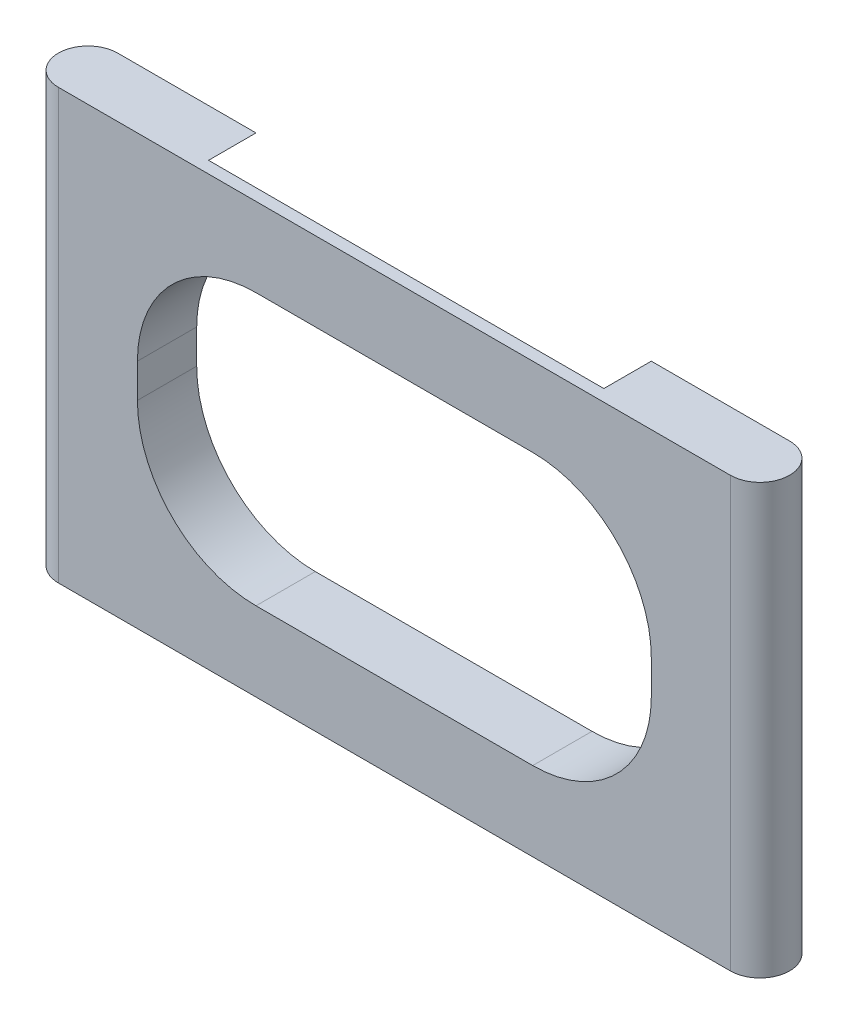
ISO-10303-21;
HEADER;
FILE_DESCRIPTION(('STEP AP214'),'2;1');
FILE_NAME('part.step','',(''),(''),'','','');
FILE_SCHEMA(('AUTOMOTIVE_DESIGN { 1 0 10303 214 1 1 1 1 }'));
ENDSEC;
DATA;
#1=APPLICATION_CONTEXT('core data for automotive mechanical design processes');
#2=APPLICATION_PROTOCOL_DEFINITION('international standard','automotive_design',2000,#1);
#3=PRODUCT_CONTEXT('',#1,'mechanical');
#4=PRODUCT('Part','Part','',(#3));
#5=PRODUCT_RELATED_PRODUCT_CATEGORY('part','',(#4));
#6=PRODUCT_DEFINITION_FORMATION('','',#4);
#7=PRODUCT_DEFINITION_CONTEXT('part definition',#1,'design');
#8=PRODUCT_DEFINITION('design','',#6,#7);
#9=PRODUCT_DEFINITION_SHAPE('','',#8);
#10=(LENGTH_UNIT() NAMED_UNIT(*) SI_UNIT(.MILLI.,.METRE.));
#11=(NAMED_UNIT(*) PLANE_ANGLE_UNIT() SI_UNIT($,.RADIAN.));
#12=(NAMED_UNIT(*) SI_UNIT($,.STERADIAN.) SOLID_ANGLE_UNIT());
#13=UNCERTAINTY_MEASURE_WITH_UNIT(LENGTH_MEASURE(1.E-05),#10,'distance_accuracy_value','');
#14=(GEOMETRIC_REPRESENTATION_CONTEXT(3) GLOBAL_UNCERTAINTY_ASSIGNED_CONTEXT((#13)) GLOBAL_UNIT_ASSIGNED_CONTEXT((#10,
#11,#12)) REPRESENTATION_CONTEXT('',''));
#15=CARTESIAN_POINT('',(0.,0.,0.));
#16=DIRECTION('',(0.,0.,1.));
#17=DIRECTION('',(1.,0.,0.));
#18=AXIS2_PLACEMENT_3D('',#15,#16,#17);
#19=CARTESIAN_POINT('',(-85.,117.6,0.));
#20=DIRECTION('',(0.,-1.,0.));
#21=DIRECTION('',(0.,0.,-1.));
#22=AXIS2_PLACEMENT_3D('',#19,#20,#21);
#23=CYLINDRICAL_SURFACE('',#22,7.50000000000001);
#24=CARTESIAN_POINT('',(-85.,113.1,0.));
#25=DIRECTION('',(0.,1.,0.));
#26=DIRECTION('',(0.,0.,1.));
#27=AXIS2_PLACEMENT_3D('',#24,#25,#26);
#28=CIRCLE('',#27,7.50000000000001);
#29=CARTESIAN_POINT('',(-85.,113.1,-7.5));
#30=VERTEX_POINT('',#29);
#31=CARTESIAN_POINT('',(-85.,113.1,7.50000000000002));
#32=VERTEX_POINT('',#31);
#33=EDGE_CURVE('E262',#30,#32,#28,.T.);
#34=ORIENTED_EDGE('',*,*,#33,.F.);
#35=DIRECTION('',(0.,-1.,0.));
#36=VECTOR('',#35,1.);
#37=CARTESIAN_POINT('',(-85.,117.6,-7.5));
#38=LINE('',#37,#36);
#39=CARTESIAN_POINT('',(-85.,78.1,-7.49999999999999));
#40=VERTEX_POINT('',#39);
#41=EDGE_CURVE('E12',#30,#40,#38,.T.);
#42=ORIENTED_EDGE('',*,*,#41,.T.);
#43=DIRECTION('',(0.,1.,0.));
#44=VECTOR('',#43,1.);
#45=CARTESIAN_POINT('',(-85.,78.1,-7.49999999999999));
#46=LINE('',#45,#44);
#47=CARTESIAN_POINT('',(-85.,39.5,-7.49999999999999));
#48=VERTEX_POINT('',#47);
#49=EDGE_CURVE('E289',#48,#40,#46,.T.);
#50=ORIENTED_EDGE('',*,*,#49,.F.);
#51=CARTESIAN_POINT('',(-85.,4.5,-7.50000000000001));
#52=VERTEX_POINT('',#51);
#53=EDGE_CURVE('E84',#48,#52,#38,.T.);
#54=ORIENTED_EDGE('',*,*,#53,.T.);
#55=CARTESIAN_POINT('',(-85.,4.5,0.));
#56=DIRECTION('',(0.,-1.,0.));
#57=DIRECTION('',(0.,0.,-1.));
#58=AXIS2_PLACEMENT_3D('',#55,#56,#57);
#59=CIRCLE('',#58,7.50000000000001);
#60=CARTESIAN_POINT('',(-85.,4.50000000000006,7.50000000000002));
#61=VERTEX_POINT('',#60);
#62=EDGE_CURVE('E349',#61,#52,#59,.T.);
#63=ORIENTED_EDGE('',*,*,#62,.F.);
#64=DIRECTION('',(0.,-1.,0.));
#65=VECTOR('',#64,1.);
#66=CARTESIAN_POINT('',(-85.,117.6,7.50000000000002));
#67=LINE('',#66,#65);
#68=EDGE_CURVE('E279',#32,#61,#67,.T.);
#69=ORIENTED_EDGE('',*,*,#68,.F.);
#70=EDGE_LOOP('',(#34,#42,#50,#54,#63,#69));
#71=FACE_BOUND('',#70,.T.);
#72=ADVANCED_FACE('F75',(#71),#23,.T.);
#73=CARTESIAN_POINT('',(0.,117.6,7.50000000000001));
#74=DIRECTION('',(0.,0.,1.));
#75=DIRECTION('',(1.,0.,0.));
#76=AXIS2_PLACEMENT_3D('',#73,#74,#75);
#77=PLANE('',#76);
#78=CARTESIAN_POINT('',(35.,54.5,7.50000000000003));
#79=DIRECTION('',(0.,0.,-1.));
#80=DIRECTION('',(-1.,0.,0.));
#81=AXIS2_PLACEMENT_3D('',#78,#79,#80);
#82=CIRCLE('',#81,30.);
#83=CARTESIAN_POINT('',(65.,54.5,7.50000000000002));
#84=VERTEX_POINT('',#83);
#85=CARTESIAN_POINT('',(35.,24.5,7.50000000000003));
#86=VERTEX_POINT('',#85);
#87=EDGE_CURVE('E367',#84,#86,#82,.T.);
#88=ORIENTED_EDGE('',*,*,#87,.T.);
#89=DIRECTION('',(-1.,0.,0.));
#90=VECTOR('',#89,1.);
#91=CARTESIAN_POINT('',(35.,24.5,7.50000000000003));
#92=LINE('',#91,#90);
#93=CARTESIAN_POINT('',(-35.,24.5,7.50000000000002));
#94=VERTEX_POINT('',#93);
#95=EDGE_CURVE('E371',#86,#94,#92,.T.);
#96=ORIENTED_EDGE('',*,*,#95,.T.);
#97=CARTESIAN_POINT('',(-35.,54.5,7.50000000000004));
#98=DIRECTION('',(0.,0.,-1.));
#99=DIRECTION('',(-1.,0.,0.));
#100=AXIS2_PLACEMENT_3D('',#97,#98,#99);
#101=CIRCLE('',#100,30.);
#102=CARTESIAN_POINT('',(-65.,54.5,7.50000000000005));
#103=VERTEX_POINT('',#102);
#104=EDGE_CURVE('E91',#94,#103,#101,.T.);
#105=ORIENTED_EDGE('',*,*,#104,.T.);
#106=DIRECTION('',(0.,1.,0.));
#107=VECTOR('',#106,1.);
#108=CARTESIAN_POINT('',(-65.,54.5,7.50000000000005));
#109=LINE('',#108,#107);
#110=CARTESIAN_POINT('',(-65.,63.1,7.50000000000004));
#111=VERTEX_POINT('',#110);
#112=EDGE_CURVE('E378',#103,#111,#109,.T.);
#113=ORIENTED_EDGE('',*,*,#112,.T.);
#114=CARTESIAN_POINT('',(-35.,63.1,7.50000000000004));
#115=DIRECTION('',(0.,0.,-1.));
#116=DIRECTION('',(-1.,0.,0.));
#117=AXIS2_PLACEMENT_3D('',#114,#115,#116);
#118=CIRCLE('',#117,30.);
#119=CARTESIAN_POINT('',(-35.,93.1,7.50000000000004));
#120=VERTEX_POINT('',#119);
#121=EDGE_CURVE('E382',#111,#120,#118,.T.);
#122=ORIENTED_EDGE('',*,*,#121,.T.);
#123=DIRECTION('',(1.,0.,0.));
#124=VECTOR('',#123,1.);
#125=CARTESIAN_POINT('',(-35.,93.1,7.50000000000004));
#126=LINE('',#125,#124);
#127=CARTESIAN_POINT('',(35.,93.1,7.50000000000003));
#128=VERTEX_POINT('',#127);
#129=EDGE_CURVE('E386',#120,#128,#126,.T.);
#130=ORIENTED_EDGE('',*,*,#129,.T.);
#131=CARTESIAN_POINT('',(35.,63.1,7.50000000000003));
#132=DIRECTION('',(0.,0.,-1.));
#133=DIRECTION('',(-1.,0.,0.));
#134=AXIS2_PLACEMENT_3D('',#131,#132,#133);
#135=CIRCLE('',#134,30.);
#136=CARTESIAN_POINT('',(65.,63.1,7.50000000000002));
#137=VERTEX_POINT('',#136);
#138=EDGE_CURVE('E390',#128,#137,#135,.T.);
#139=ORIENTED_EDGE('',*,*,#138,.T.);
#140=DIRECTION('',(0.,-1.,0.));
#141=VECTOR('',#140,1.);
#142=CARTESIAN_POINT('',(65.,63.1,7.50000000000002));
#143=LINE('',#142,#141);
#144=EDGE_CURVE('E394',#137,#84,#143,.T.);
#145=ORIENTED_EDGE('',*,*,#144,.T.);
#146=EDGE_LOOP('',(#88,#96,#105,#113,#122,#130,#139,#145));
#147=FACE_BOUND('',#146,.T.);
#148=DIRECTION('',(0.,-1.,0.));
#149=VECTOR('',#148,1.);
#150=CARTESIAN_POINT('',(85.,117.6,7.5));
#151=LINE('',#150,#149);
#152=CARTESIAN_POINT('',(85.,113.1,7.5));
#153=VERTEX_POINT('',#152);
#154=CARTESIAN_POINT('',(85.,4.5,7.5));
#155=VERTEX_POINT('',#154);
#156=EDGE_CURVE('E340',#153,#155,#151,.T.);
#157=ORIENTED_EDGE('',*,*,#156,.F.);
#158=DIRECTION('',(1.,0.,0.));
#159=VECTOR('',#158,1.);
#160=CARTESIAN_POINT('',(50.,113.1,7.50000000000001));
#161=LINE('',#160,#159);
#162=EDGE_CURVE('E282',#32,#153,#161,.T.);
#163=ORIENTED_EDGE('',*,*,#162,.F.);
#164=ORIENTED_EDGE('',*,*,#68,.T.);
#165=DIRECTION('',(1.,0.,0.));
#166=VECTOR('',#165,1.);
#167=CARTESIAN_POINT('',(0.,4.5,7.50000000000001));
#168=LINE('',#167,#166);
#169=EDGE_CURVE('E362',#61,#155,#168,.T.);
#170=ORIENTED_EDGE('',*,*,#169,.T.);
#171=EDGE_LOOP('',(#157,#163,#164,#170));
#172=FACE_BOUND('',#171,.T.);
#173=ADVANCED_FACE('F610',(#147,#172),#77,.T.);
#174=CARTESIAN_POINT('',(85.,117.6,0.));
#175=DIRECTION('',(0.,-1.,0.));
#176=DIRECTION('',(0.,0.,-1.));
#177=AXIS2_PLACEMENT_3D('',#174,#175,#176);
#178=CYLINDRICAL_SURFACE('',#177,7.5);
#179=CARTESIAN_POINT('',(85.,113.1,0.));
#180=DIRECTION('',(0.,1.,0.));
#181=DIRECTION('',(0.,0.,1.));
#182=AXIS2_PLACEMENT_3D('',#179,#180,#181);
#183=CIRCLE('',#182,7.5);
#184=CARTESIAN_POINT('',(85.,113.1,-7.5));
#185=VERTEX_POINT('',#184);
#186=EDGE_CURVE('E271',#153,#185,#183,.T.);
#187=ORIENTED_EDGE('',*,*,#186,.F.);
#188=ORIENTED_EDGE('',*,*,#156,.T.);
#189=CARTESIAN_POINT('',(85.,4.5,0.));
#190=DIRECTION('',(0.,-1.,0.));
#191=DIRECTION('',(0.,0.,-1.));
#192=AXIS2_PLACEMENT_3D('',#189,#190,#191);
#193=CIRCLE('',#192,7.5);
#194=CARTESIAN_POINT('',(85.,4.5,-7.5));
#195=VERTEX_POINT('',#194);
#196=EDGE_CURVE('E281',#195,#155,#193,.T.);
#197=ORIENTED_EDGE('',*,*,#196,.F.);
#198=DIRECTION('',(0.,-1.,0.));
#199=VECTOR('',#198,1.);
#200=CARTESIAN_POINT('',(85.,117.6,-7.5));
#201=LINE('',#200,#199);
#202=CARTESIAN_POINT('',(85.,39.5,-7.50000000000001));
#203=VERTEX_POINT('',#202);
#204=EDGE_CURVE('E313',#203,#195,#201,.T.);
#205=ORIENTED_EDGE('',*,*,#204,.F.);
#206=DIRECTION('',(0.,-1.,0.));
#207=VECTOR('',#206,1.);
#208=CARTESIAN_POINT('',(85.,78.1,-7.50000000000001));
#209=LINE('',#208,#207);
#210=CARTESIAN_POINT('',(85.,78.1,-7.5));
#211=VERTEX_POINT('',#210);
#212=EDGE_CURVE('E294',#211,#203,#209,.T.);
#213=ORIENTED_EDGE('',*,*,#212,.F.);
#214=EDGE_CURVE('E337',#185,#211,#201,.T.);
#215=ORIENTED_EDGE('',*,*,#214,.F.);
#216=EDGE_LOOP('',(#187,#188,#197,#205,#213,#215));
#217=FACE_BOUND('',#216,.T.);
#218=ADVANCED_FACE('F596',(#217),#178,.T.);
#219=CARTESIAN_POINT('',(0.,117.6,-7.5));
#220=DIRECTION('',(0.,0.,1.));
#221=DIRECTION('',(1.,0.,0.));
#222=AXIS2_PLACEMENT_3D('',#219,#220,#221);
#223=PLANE('',#222);
#224=DIRECTION('',(1.,0.,0.));
#225=VECTOR('',#224,1.);
#226=CARTESIAN_POINT('',(50.,113.1,-7.5));
#227=LINE('',#226,#225);
#228=CARTESIAN_POINT('',(50.,113.1,-7.5));
#229=VERTEX_POINT('',#228);
#230=EDGE_CURVE('E272',#229,#185,#227,.T.);
#231=ORIENTED_EDGE('',*,*,#230,.T.);
#232=ORIENTED_EDGE('',*,*,#214,.T.);
#233=CARTESIAN_POINT('',(50.,78.1,-7.50000000000001));
#234=DIRECTION('',(0.,0.,-1.));
#235=DIRECTION('',(-1.,0.,0.));
#236=AXIS2_PLACEMENT_3D('',#233,#234,#235);
#237=CIRCLE('',#236,35.);
#238=EDGE_CURVE('E288',#229,#211,#237,.T.);
#239=ORIENTED_EDGE('',*,*,#238,.F.);
#240=EDGE_LOOP('',(#231,#232,#239));
#241=FACE_BOUND('',#240,.T.);
#242=ADVANCED_FACE('F77',(#241),#223,.F.);
#243=CARTESIAN_POINT('',(-50.,113.1,-7.5));
#244=VERTEX_POINT('',#243);
#245=EDGE_CURVE('E259',#30,#244,#227,.T.);
#246=ORIENTED_EDGE('',*,*,#245,.T.);
#247=CARTESIAN_POINT('',(-50.,78.1,-7.49999999999999));
#248=DIRECTION('',(0.,0.,-1.));
#249=DIRECTION('',(1.,0.,0.));
#250=AXIS2_PLACEMENT_3D('',#247,#248,#249);
#251=CIRCLE('',#250,35.);
#252=EDGE_CURVE('E285',#40,#244,#251,.T.);
#253=ORIENTED_EDGE('',*,*,#252,.F.);
#254=ORIENTED_EDGE('',*,*,#41,.F.);
#255=EDGE_LOOP('',(#246,#253,#254));
#256=FACE_BOUND('',#255,.T.);
#257=ADVANCED_FACE('F284',(#256),#223,.F.);
#258=DIRECTION('',(1.,0.,0.));
#259=VECTOR('',#258,1.);
#260=CARTESIAN_POINT('',(0.,4.5,-7.5));
#261=LINE('',#260,#259);
#262=CARTESIAN_POINT('',(-50.,4.5,-7.5));
#263=VERTEX_POINT('',#262);
#264=EDGE_CURVE('E355',#52,#263,#261,.T.);
#265=ORIENTED_EDGE('',*,*,#264,.F.);
#266=ORIENTED_EDGE('',*,*,#53,.F.);
#267=CARTESIAN_POINT('',(-50.,39.5,-7.49999999999999));
#268=DIRECTION('',(0.,0.,-1.));
#269=DIRECTION('',(-1.,0.,0.));
#270=AXIS2_PLACEMENT_3D('',#267,#268,#269);
#271=CIRCLE('',#270,35.);
#272=EDGE_CURVE('E297',#263,#48,#271,.T.);
#273=ORIENTED_EDGE('',*,*,#272,.F.);
#274=EDGE_LOOP('',(#265,#266,#273));
#275=FACE_BOUND('',#274,.T.);
#276=ADVANCED_FACE('F353',(#275),#223,.F.);
#277=CARTESIAN_POINT('',(50.,4.5,-7.5));
#278=VERTEX_POINT('',#277);
#279=EDGE_CURVE('E358',#278,#195,#261,.T.);
#280=ORIENTED_EDGE('',*,*,#279,.F.);
#281=CARTESIAN_POINT('',(50.,39.5,-7.50000000000001));
#282=DIRECTION('',(0.,0.,-1.));
#283=DIRECTION('',(-1.,0.,0.));
#284=AXIS2_PLACEMENT_3D('',#281,#282,#283);
#285=CIRCLE('',#284,35.);
#286=EDGE_CURVE('E304',#203,#278,#285,.T.);
#287=ORIENTED_EDGE('',*,*,#286,.F.);
#288=ORIENTED_EDGE('',*,*,#204,.T.);
#289=EDGE_LOOP('',(#280,#287,#288));
#290=FACE_BOUND('',#289,.T.);
#291=ADVANCED_FACE('F593',(#290),#223,.F.);
#292=CARTESIAN_POINT('',(-50.,39.5,4.50000000000001));
#293=DIRECTION('',(0.,0.,-1.));
#294=DIRECTION('',(-1.,0.,0.));
#295=AXIS2_PLACEMENT_3D('',#292,#293,#294);
#296=CYLINDRICAL_SURFACE('',#295,35.);
#297=ORIENTED_EDGE('',*,*,#272,.T.);
#298=DIRECTION('',(0.,0.,-1.));
#299=VECTOR('',#298,1.);
#300=CARTESIAN_POINT('',(-85.,39.5,4.50000000000001));
#301=LINE('',#300,#299);
#302=CARTESIAN_POINT('',(-85.,39.5,4.50000000000001));
#303=VERTEX_POINT('',#302);
#304=EDGE_CURVE('E333',#303,#48,#301,.T.);
#305=ORIENTED_EDGE('',*,*,#304,.F.);
#306=CARTESIAN_POINT('',(-50.,39.5,4.50000000000001));
#307=DIRECTION('',(0.,0.,-1.));
#308=DIRECTION('',(-1.,0.,0.));
#309=AXIS2_PLACEMENT_3D('',#306,#307,#308);
#310=CIRCLE('',#309,35.);
#311=CARTESIAN_POINT('',(-50.,4.5,4.50000000000001));
#312=VERTEX_POINT('',#311);
#313=EDGE_CURVE('E308',#312,#303,#310,.T.);
#314=ORIENTED_EDGE('',*,*,#313,.F.);
#315=DIRECTION('',(0.,0.,-1.));
#316=VECTOR('',#315,1.);
#317=CARTESIAN_POINT('',(-50.,4.5,4.50000000000001));
#318=LINE('',#317,#316);
#319=EDGE_CURVE('E309',#312,#263,#318,.T.);
#320=ORIENTED_EDGE('',*,*,#319,.T.);
#321=EDGE_LOOP('',(#297,#305,#314,#320));
#322=FACE_BOUND('',#321,.T.);
#323=ADVANCED_FACE('F571',(#322),#296,.F.);
#324=CARTESIAN_POINT('',(50.,39.5,4.49999999999999));
#325=DIRECTION('',(0.,0.,-1.));
#326=DIRECTION('',(-1.,0.,0.));
#327=AXIS2_PLACEMENT_3D('',#324,#325,#326);
#328=CYLINDRICAL_SURFACE('',#327,35.);
#329=ORIENTED_EDGE('',*,*,#286,.T.);
#330=DIRECTION('',(0.,0.,-1.));
#331=VECTOR('',#330,1.);
#332=CARTESIAN_POINT('',(50.,4.5,4.49999999999999));
#333=LINE('',#332,#331);
#334=CARTESIAN_POINT('',(50.,4.5,4.49999999999999));
#335=VERTEX_POINT('',#334);
#336=EDGE_CURVE('E314',#335,#278,#333,.T.);
#337=ORIENTED_EDGE('',*,*,#336,.F.);
#338=CARTESIAN_POINT('',(50.,39.5,4.49999999999999));
#339=DIRECTION('',(0.,0.,-1.));
#340=DIRECTION('',(-1.,0.,0.));
#341=AXIS2_PLACEMENT_3D('',#338,#339,#340);
#342=CIRCLE('',#341,35.);
#343=CARTESIAN_POINT('',(85.,39.5,4.49999999999999));
#344=VERTEX_POINT('',#343);
#345=EDGE_CURVE('E563',#344,#335,#342,.T.);
#346=ORIENTED_EDGE('',*,*,#345,.F.);
#347=DIRECTION('',(0.,0.,-1.));
#348=VECTOR('',#347,1.);
#349=CARTESIAN_POINT('',(85.,39.5,4.49999999999999));
#350=LINE('',#349,#348);
#351=EDGE_CURVE('E317',#344,#203,#350,.T.);
#352=ORIENTED_EDGE('',*,*,#351,.T.);
#353=EDGE_LOOP('',(#329,#337,#346,#352));
#354=FACE_BOUND('',#353,.T.);
#355=ADVANCED_FACE('F580',(#354),#328,.F.);
#356=CARTESIAN_POINT('',(85.,78.1,4.49999999999999));
#357=DIRECTION('',(1.,0.,0.));
#358=DIRECTION('',(0.,0.,-1.));
#359=AXIS2_PLACEMENT_3D('',#356,#357,#358);
#360=PLANE('',#359);
#361=ORIENTED_EDGE('',*,*,#212,.T.);
#362=ORIENTED_EDGE('',*,*,#351,.F.);
#363=DIRECTION('',(0.,-1.,0.));
#364=VECTOR('',#363,1.);
#365=CARTESIAN_POINT('',(85.,78.1,4.49999999999999));
#366=LINE('',#365,#364);
#367=CARTESIAN_POINT('',(85.,78.1,4.49999999999999));
#368=VERTEX_POINT('',#367);
#369=EDGE_CURVE('E559',#368,#344,#366,.T.);
#370=ORIENTED_EDGE('',*,*,#369,.F.);
#371=DIRECTION('',(0.,0.,-1.));
#372=VECTOR('',#371,1.);
#373=CARTESIAN_POINT('',(85.,78.1,4.49999999999999));
#374=LINE('',#373,#372);
#375=EDGE_CURVE('E320',#368,#211,#374,.T.);
#376=ORIENTED_EDGE('',*,*,#375,.T.);
#377=EDGE_LOOP('',(#361,#362,#370,#376));
#378=FACE_BOUND('',#377,.T.);
#379=ADVANCED_FACE('F586',(#378),#360,.F.);
#380=CARTESIAN_POINT('',(50.,78.1,4.49999999999999));
#381=DIRECTION('',(0.,0.,-1.));
#382=DIRECTION('',(-1.,0.,0.));
#383=AXIS2_PLACEMENT_3D('',#380,#381,#382);
#384=CYLINDRICAL_SURFACE('',#383,35.);
#385=ORIENTED_EDGE('',*,*,#238,.T.);
#386=ORIENTED_EDGE('',*,*,#375,.F.);
#387=CARTESIAN_POINT('',(50.,78.1,4.49999999999999));
#388=DIRECTION('',(0.,0.,-1.));
#389=DIRECTION('',(-1.,0.,0.));
#390=AXIS2_PLACEMENT_3D('',#387,#388,#389);
#391=CIRCLE('',#390,35.);
#392=CARTESIAN_POINT('',(50.,113.1,4.49999999999999));
#393=VERTEX_POINT('',#392);
#394=EDGE_CURVE('E555',#393,#368,#391,.T.);
#395=ORIENTED_EDGE('',*,*,#394,.F.);
#396=DIRECTION('',(0.,0.,-1.));
#397=VECTOR('',#396,1.);
#398=CARTESIAN_POINT('',(50.,113.1,4.49999999999999));
#399=LINE('',#398,#397);
#400=EDGE_CURVE('E324',#393,#229,#399,.T.);
#401=ORIENTED_EDGE('',*,*,#400,.T.);
#402=EDGE_LOOP('',(#385,#386,#395,#401));
#403=FACE_BOUND('',#402,.T.);
#404=ADVANCED_FACE('F612',(#403),#384,.F.);
#405=CARTESIAN_POINT('',(-50.,78.1,4.50000000000001));
#406=DIRECTION('',(0.,0.,-1.));
#407=DIRECTION('',(-1.,0.,0.));
#408=AXIS2_PLACEMENT_3D('',#405,#406,#407);
#409=CYLINDRICAL_SURFACE('',#408,35.);
#410=ORIENTED_EDGE('',*,*,#252,.T.);
#411=DIRECTION('',(0.,0.,-1.));
#412=VECTOR('',#411,1.);
#413=CARTESIAN_POINT('',(-50.,113.1,4.50000000000001));
#414=LINE('',#413,#412);
#415=CARTESIAN_POINT('',(-50.,113.1,4.50000000000001));
#416=VERTEX_POINT('',#415);
#417=EDGE_CURVE('E265',#416,#244,#414,.T.);
#418=ORIENTED_EDGE('',*,*,#417,.F.);
#419=CARTESIAN_POINT('',(-50.,78.1,4.50000000000001));
#420=DIRECTION('',(0.,0.,-1.));
#421=DIRECTION('',(1.,0.,0.));
#422=AXIS2_PLACEMENT_3D('',#419,#420,#421);
#423=CIRCLE('',#422,35.);
#424=CARTESIAN_POINT('',(-85.,78.1,4.50000000000001));
#425=VERTEX_POINT('',#424);
#426=EDGE_CURVE('E547',#425,#416,#423,.T.);
#427=ORIENTED_EDGE('',*,*,#426,.F.);
#428=DIRECTION('',(0.,0.,-1.));
#429=VECTOR('',#428,1.);
#430=CARTESIAN_POINT('',(-85.,78.1,4.50000000000001));
#431=LINE('',#430,#429);
#432=EDGE_CURVE('E330',#425,#40,#431,.T.);
#433=ORIENTED_EDGE('',*,*,#432,.T.);
#434=EDGE_LOOP('',(#410,#418,#427,#433));
#435=FACE_BOUND('',#434,.T.);
#436=ADVANCED_FACE('F614',(#435),#409,.F.);
#437=CARTESIAN_POINT('',(-85.,78.1,4.50000000000001));
#438=DIRECTION('',(-1.,0.,0.));
#439=DIRECTION('',(0.,-1.,0.));
#440=AXIS2_PLACEMENT_3D('',#437,#438,#439);
#441=PLANE('',#440);
#442=ORIENTED_EDGE('',*,*,#49,.T.);
#443=ORIENTED_EDGE('',*,*,#432,.F.);
#444=DIRECTION('',(0.,1.,0.));
#445=VECTOR('',#444,1.);
#446=CARTESIAN_POINT('',(-85.,78.1,4.50000000000001));
#447=LINE('',#446,#445);
#448=EDGE_CURVE('E543',#303,#425,#447,.T.);
#449=ORIENTED_EDGE('',*,*,#448,.F.);
#450=ORIENTED_EDGE('',*,*,#304,.T.);
#451=EDGE_LOOP('',(#442,#443,#449,#450));
#452=FACE_BOUND('',#451,.T.);
#453=ADVANCED_FACE('F616',(#452),#441,.F.);
#454=CARTESIAN_POINT('',(-50.,39.5,4.50000000000001));
#455=DIRECTION('',(0.,0.,-1.));
#456=DIRECTION('',(-1.,0.,0.));
#457=AXIS2_PLACEMENT_3D('',#454,#455,#456);
#458=PLANE('',#457);
#459=DIRECTION('',(-1.,0.,0.));
#460=VECTOR('',#459,1.);
#461=CARTESIAN_POINT('',(35.,19.5,4.5));
#462=LINE('',#461,#460);
#463=CARTESIAN_POINT('',(35.,19.5,4.5));
#464=VERTEX_POINT('',#463);
#465=CARTESIAN_POINT('',(-35.,19.5,4.50000000000001));
#466=VERTEX_POINT('',#465);
#467=EDGE_CURVE('E481',#464,#466,#462,.T.);
#468=ORIENTED_EDGE('',*,*,#467,.F.);
#469=CARTESIAN_POINT('',(35.,54.5,4.5));
#470=DIRECTION('',(0.,0.,-1.));
#471=DIRECTION('',(-1.,0.,0.));
#472=AXIS2_PLACEMENT_3D('',#469,#470,#471);
#473=CIRCLE('',#472,35.);
#474=CARTESIAN_POINT('',(70.,54.5,4.49999999999999));
#475=VERTEX_POINT('',#474);
#476=EDGE_CURVE('E477',#475,#464,#473,.T.);
#477=ORIENTED_EDGE('',*,*,#476,.F.);
#478=DIRECTION('',(0.,-1.,0.));
#479=VECTOR('',#478,1.);
#480=CARTESIAN_POINT('',(70.,63.1,4.49999999999999));
#481=LINE('',#480,#479);
#482=CARTESIAN_POINT('',(70.,63.1,4.49999999999999));
#483=VERTEX_POINT('',#482);
#484=EDGE_CURVE('E473',#483,#475,#481,.T.);
#485=ORIENTED_EDGE('',*,*,#484,.F.);
#486=CARTESIAN_POINT('',(35.,63.1,4.5));
#487=DIRECTION('',(0.,0.,-1.));
#488=DIRECTION('',(1.,0.,0.));
#489=AXIS2_PLACEMENT_3D('',#486,#487,#488);
#490=CIRCLE('',#489,35.);
#491=CARTESIAN_POINT('',(35.,98.1,4.5));
#492=VERTEX_POINT('',#491);
#493=EDGE_CURVE('E469',#492,#483,#490,.T.);
#494=ORIENTED_EDGE('',*,*,#493,.F.);
#495=DIRECTION('',(1.,0.,0.));
#496=VECTOR('',#495,1.);
#497=CARTESIAN_POINT('',(35.,98.1,4.5));
#498=LINE('',#497,#496);
#499=CARTESIAN_POINT('',(-35.,98.1,4.50000000000001));
#500=VERTEX_POINT('',#499);
#501=EDGE_CURVE('E465',#500,#492,#498,.T.);
#502=ORIENTED_EDGE('',*,*,#501,.F.);
#503=CARTESIAN_POINT('',(-35.,63.1,4.50000000000001));
#504=DIRECTION('',(0.,0.,-1.));
#505=DIRECTION('',(-1.,0.,0.));
#506=AXIS2_PLACEMENT_3D('',#503,#504,#505);
#507=CIRCLE('',#506,35.);
#508=CARTESIAN_POINT('',(-70.,63.1,4.50000000000001));
#509=VERTEX_POINT('',#508);
#510=EDGE_CURVE('E461',#509,#500,#507,.T.);
#511=ORIENTED_EDGE('',*,*,#510,.F.);
#512=DIRECTION('',(0.,1.,0.));
#513=VECTOR('',#512,1.);
#514=CARTESIAN_POINT('',(-70.,63.1,4.50000000000001));
#515=LINE('',#514,#513);
#516=CARTESIAN_POINT('',(-70.,54.5,4.50000000000001));
#517=VERTEX_POINT('',#516);
#518=EDGE_CURVE('E456',#517,#509,#515,.T.);
#519=ORIENTED_EDGE('',*,*,#518,.F.);
#520=CARTESIAN_POINT('',(-35.,54.5,4.50000000000001));
#521=DIRECTION('',(0.,0.,-1.));
#522=DIRECTION('',(-1.,0.,0.));
#523=AXIS2_PLACEMENT_3D('',#520,#521,#522);
#524=CIRCLE('',#523,35.);
#525=EDGE_CURVE('E452',#466,#517,#524,.T.);
#526=ORIENTED_EDGE('',*,*,#525,.F.);
#527=EDGE_LOOP('',(#468,#477,#485,#494,#502,#511,#519,#526));
#528=FACE_BOUND('',#527,.T.);
#529=ORIENTED_EDGE('',*,*,#313,.T.);
#530=ORIENTED_EDGE('',*,*,#448,.T.);
#531=ORIENTED_EDGE('',*,*,#426,.T.);
#532=DIRECTION('',(1.,0.,0.));
#533=VECTOR('',#532,1.);
#534=CARTESIAN_POINT('',(50.,113.1,4.49999999999999));
#535=LINE('',#534,#533);
#536=EDGE_CURVE('E551',#416,#393,#535,.T.);
#537=ORIENTED_EDGE('',*,*,#536,.T.);
#538=ORIENTED_EDGE('',*,*,#394,.T.);
#539=ORIENTED_EDGE('',*,*,#369,.T.);
#540=ORIENTED_EDGE('',*,*,#345,.T.);
#541=DIRECTION('',(-1.,0.,0.));
#542=VECTOR('',#541,1.);
#543=CARTESIAN_POINT('',(50.,4.5,4.49999999999999));
#544=LINE('',#543,#542);
#545=EDGE_CURVE('E336',#335,#312,#544,.T.);
#546=ORIENTED_EDGE('',*,*,#545,.T.);
#547=EDGE_LOOP('',(#529,#530,#531,#537,#538,#539,#540,#546));
#548=FACE_BOUND('',#547,.T.);
#549=ADVANCED_FACE('F582',(#528,#548),#458,.T.);
#550=CARTESIAN_POINT('',(-35.,54.5,4.50000000000001));
#551=DIRECTION('',(0.,0.,-1.));
#552=DIRECTION('',(-1.,0.,0.));
#553=AXIS2_PLACEMENT_3D('',#550,#551,#552);
#554=CYLINDRICAL_SURFACE('',#553,35.);
#555=CARTESIAN_POINT('',(-35.,54.5,-7.49999999999999));
#556=DIRECTION('',(0.,0.,-1.));
#557=DIRECTION('',(-1.,0.,0.));
#558=AXIS2_PLACEMENT_3D('',#555,#556,#557);
#559=CIRCLE('',#558,35.);
#560=CARTESIAN_POINT('',(-35.,19.5,-7.49999999999999));
#561=VERTEX_POINT('',#560);
#562=CARTESIAN_POINT('',(-70.,54.5,-7.49999999999999));
#563=VERTEX_POINT('',#562);
#564=EDGE_CURVE('E431',#561,#563,#559,.T.);
#565=ORIENTED_EDGE('',*,*,#564,.F.);
#566=DIRECTION('',(0.,0.,-1.));
#567=VECTOR('',#566,1.);
#568=CARTESIAN_POINT('',(-35.,19.5,4.50000000000001));
#569=LINE('',#568,#567);
#570=EDGE_CURVE('E516',#466,#561,#569,.T.);
#571=ORIENTED_EDGE('',*,*,#570,.F.);
#572=ORIENTED_EDGE('',*,*,#525,.T.);
#573=DIRECTION('',(0.,0.,-1.));
#574=VECTOR('',#573,1.);
#575=CARTESIAN_POINT('',(-70.,54.5,4.50000000000001));
#576=LINE('',#575,#574);
#577=EDGE_CURVE('E485',#517,#563,#576,.T.);
#578=ORIENTED_EDGE('',*,*,#577,.T.);
#579=EDGE_LOOP('',(#565,#571,#572,#578));
#580=FACE_BOUND('',#579,.T.);
#581=ADVANCED_FACE('F623',(#580),#554,.T.);
#582=CARTESIAN_POINT('',(35.,19.5,4.5));
#583=DIRECTION('',(0.,-1.,0.));
#584=DIRECTION('',(0.,0.,-1.));
#585=AXIS2_PLACEMENT_3D('',#582,#583,#584);
#586=PLANE('',#585);
#587=DIRECTION('',(-1.,0.,0.));
#588=VECTOR('',#587,1.);
#589=CARTESIAN_POINT('',(35.,19.5,-7.5));
#590=LINE('',#589,#588);
#591=CARTESIAN_POINT('',(35.,19.5,-7.5));
#592=VERTEX_POINT('',#591);
#593=EDGE_CURVE('E457',#592,#561,#590,.T.);
#594=ORIENTED_EDGE('',*,*,#593,.F.);
#595=DIRECTION('',(0.,0.,-1.));
#596=VECTOR('',#595,1.);
#597=CARTESIAN_POINT('',(35.,19.5,4.5));
#598=LINE('',#597,#596);
#599=EDGE_CURVE('E519',#464,#592,#598,.T.);
#600=ORIENTED_EDGE('',*,*,#599,.F.);
#601=ORIENTED_EDGE('',*,*,#467,.T.);
#602=ORIENTED_EDGE('',*,*,#570,.T.);
#603=EDGE_LOOP('',(#594,#600,#601,#602));
#604=FACE_BOUND('',#603,.T.);
#605=ADVANCED_FACE('F788',(#604),#586,.T.);
#606=CARTESIAN_POINT('',(35.,54.5,4.5));
#607=DIRECTION('',(0.,0.,-1.));
#608=DIRECTION('',(-1.,0.,0.));
#609=AXIS2_PLACEMENT_3D('',#606,#607,#608);
#610=CYLINDRICAL_SURFACE('',#609,35.);
#611=CARTESIAN_POINT('',(35.,54.5,-7.5));
#612=DIRECTION('',(0.,0.,-1.));
#613=DIRECTION('',(-1.,0.,0.));
#614=AXIS2_PLACEMENT_3D('',#611,#612,#613);
#615=CIRCLE('',#614,35.);
#616=CARTESIAN_POINT('',(70.,54.5,-7.50000000000001));
#617=VERTEX_POINT('',#616);
#618=EDGE_CURVE('E509',#617,#592,#615,.T.);
#619=ORIENTED_EDGE('',*,*,#618,.F.);
#620=DIRECTION('',(0.,0.,-1.));
#621=VECTOR('',#620,1.);
#622=CARTESIAN_POINT('',(70.,54.5,4.49999999999999));
#623=LINE('',#622,#621);
#624=EDGE_CURVE('E522',#475,#617,#623,.T.);
#625=ORIENTED_EDGE('',*,*,#624,.F.);
#626=ORIENTED_EDGE('',*,*,#476,.T.);
#627=ORIENTED_EDGE('',*,*,#599,.T.);
#628=EDGE_LOOP('',(#619,#625,#626,#627));
#629=FACE_BOUND('',#628,.T.);
#630=ADVANCED_FACE('F798',(#629),#610,.T.);
#631=CARTESIAN_POINT('',(70.,63.1,4.49999999999999));
#632=DIRECTION('',(1.,0.,0.));
#633=DIRECTION('',(0.,0.,-1.));
#634=AXIS2_PLACEMENT_3D('',#631,#632,#633);
#635=PLANE('',#634);
#636=DIRECTION('',(0.,-1.,0.));
#637=VECTOR('',#636,1.);
#638=CARTESIAN_POINT('',(70.,63.1,-7.50000000000001));
#639=LINE('',#638,#637);
#640=CARTESIAN_POINT('',(70.,63.1,-7.50000000000001));
#641=VERTEX_POINT('',#640);
#642=EDGE_CURVE('E505',#641,#617,#639,.T.);
#643=ORIENTED_EDGE('',*,*,#642,.F.);
#644=DIRECTION('',(0.,0.,-1.));
#645=VECTOR('',#644,1.);
#646=CARTESIAN_POINT('',(70.,63.1,4.49999999999999));
#647=LINE('',#646,#645);
#648=EDGE_CURVE('E525',#483,#641,#647,.T.);
#649=ORIENTED_EDGE('',*,*,#648,.F.);
#650=ORIENTED_EDGE('',*,*,#484,.T.);
#651=ORIENTED_EDGE('',*,*,#624,.T.);
#652=EDGE_LOOP('',(#643,#649,#650,#651));
#653=FACE_BOUND('',#652,.T.);
#654=ADVANCED_FACE('F808',(#653),#635,.T.);
#655=CARTESIAN_POINT('',(35.,63.1,4.5));
#656=DIRECTION('',(0.,0.,-1.));
#657=DIRECTION('',(-1.,0.,0.));
#658=AXIS2_PLACEMENT_3D('',#655,#656,#657);
#659=CYLINDRICAL_SURFACE('',#658,35.);
#660=CARTESIAN_POINT('',(35.,63.1,-7.5));
#661=DIRECTION('',(0.,0.,-1.));
#662=DIRECTION('',(1.,0.,0.));
#663=AXIS2_PLACEMENT_3D('',#660,#661,#662);
#664=CIRCLE('',#663,35.);
#665=CARTESIAN_POINT('',(35.,98.1,-7.5));
#666=VERTEX_POINT('',#665);
#667=EDGE_CURVE('E501',#666,#641,#664,.T.);
#668=ORIENTED_EDGE('',*,*,#667,.F.);
#669=DIRECTION('',(0.,0.,-1.));
#670=VECTOR('',#669,1.);
#671=CARTESIAN_POINT('',(35.,98.1,4.5));
#672=LINE('',#671,#670);
#673=EDGE_CURVE('E528',#492,#666,#672,.T.);
#674=ORIENTED_EDGE('',*,*,#673,.F.);
#675=ORIENTED_EDGE('',*,*,#493,.T.);
#676=ORIENTED_EDGE('',*,*,#648,.T.);
#677=EDGE_LOOP('',(#668,#674,#675,#676));
#678=FACE_BOUND('',#677,.T.);
#679=ADVANCED_FACE('F818',(#678),#659,.T.);
#680=CARTESIAN_POINT('',(35.,98.1,4.5));
#681=DIRECTION('',(0.,1.,0.));
#682=DIRECTION('',(0.,0.,1.));
#683=AXIS2_PLACEMENT_3D('',#680,#681,#682);
#684=PLANE('',#683);
#685=DIRECTION('',(1.,0.,0.));
#686=VECTOR('',#685,1.);
#687=CARTESIAN_POINT('',(35.,98.1,-7.5));
#688=LINE('',#687,#686);
#689=CARTESIAN_POINT('',(-35.,98.1,-7.49999999999999));
#690=VERTEX_POINT('',#689);
#691=EDGE_CURVE('E497',#690,#666,#688,.T.);
#692=ORIENTED_EDGE('',*,*,#691,.F.);
#693=DIRECTION('',(0.,0.,-1.));
#694=VECTOR('',#693,1.);
#695=CARTESIAN_POINT('',(-35.,98.1,4.50000000000001));
#696=LINE('',#695,#694);
#697=EDGE_CURVE('E531',#500,#690,#696,.T.);
#698=ORIENTED_EDGE('',*,*,#697,.F.);
#699=ORIENTED_EDGE('',*,*,#501,.T.);
#700=ORIENTED_EDGE('',*,*,#673,.T.);
#701=EDGE_LOOP('',(#692,#698,#699,#700));
#702=FACE_BOUND('',#701,.T.);
#703=ADVANCED_FACE('F828',(#702),#684,.T.);
#704=CARTESIAN_POINT('',(-35.,63.1,4.50000000000001));
#705=DIRECTION('',(0.,0.,-1.));
#706=DIRECTION('',(-1.,0.,0.));
#707=AXIS2_PLACEMENT_3D('',#704,#705,#706);
#708=CYLINDRICAL_SURFACE('',#707,35.);
#709=CARTESIAN_POINT('',(-35.,63.1,-7.49999999999999));
#710=DIRECTION('',(0.,0.,-1.));
#711=DIRECTION('',(-1.,0.,0.));
#712=AXIS2_PLACEMENT_3D('',#709,#710,#711);
#713=CIRCLE('',#712,35.);
#714=CARTESIAN_POINT('',(-70.,63.1,-7.5));
#715=VERTEX_POINT('',#714);
#716=EDGE_CURVE('E493',#715,#690,#713,.T.);
#717=ORIENTED_EDGE('',*,*,#716,.F.);
#718=DIRECTION('',(0.,0.,-1.));
#719=VECTOR('',#718,1.);
#720=CARTESIAN_POINT('',(-70.,63.1,4.50000000000001));
#721=LINE('',#720,#719);
#722=EDGE_CURVE('E534',#509,#715,#721,.T.);
#723=ORIENTED_EDGE('',*,*,#722,.F.);
#724=ORIENTED_EDGE('',*,*,#510,.T.);
#725=ORIENTED_EDGE('',*,*,#697,.T.);
#726=EDGE_LOOP('',(#717,#723,#724,#725));
#727=FACE_BOUND('',#726,.T.);
#728=ADVANCED_FACE('F656',(#727),#708,.T.);
#729=CARTESIAN_POINT('',(-70.,63.1,4.50000000000001));
#730=DIRECTION('',(-1.,0.,0.));
#731=DIRECTION('',(0.,-1.,0.));
#732=AXIS2_PLACEMENT_3D('',#729,#730,#731);
#733=PLANE('',#732);
#734=DIRECTION('',(0.,1.,0.));
#735=VECTOR('',#734,1.);
#736=CARTESIAN_POINT('',(-70.,63.1,-7.49999999999999));
#737=LINE('',#736,#735);
#738=EDGE_CURVE('E489',#563,#715,#737,.T.);
#739=ORIENTED_EDGE('',*,*,#738,.F.);
#740=ORIENTED_EDGE('',*,*,#577,.F.);
#741=ORIENTED_EDGE('',*,*,#518,.T.);
#742=ORIENTED_EDGE('',*,*,#722,.T.);
#743=EDGE_LOOP('',(#739,#740,#741,#742));
#744=FACE_BOUND('',#743,.T.);
#745=ADVANCED_FACE('F648',(#744),#733,.T.);
#746=DIRECTION('',(-1.,0.,0.));
#747=VECTOR('',#746,1.);
#748=CARTESIAN_POINT('',(35.,24.5,-7.5));
#749=LINE('',#748,#747);
#750=CARTESIAN_POINT('',(35.,24.5,-7.5));
#751=VERTEX_POINT('',#750);
#752=CARTESIAN_POINT('',(-35.,24.5,-7.49999999999999));
#753=VERTEX_POINT('',#752);
#754=EDGE_CURVE('E401',#751,#753,#749,.T.);
#755=ORIENTED_EDGE('',*,*,#754,.F.);
#756=CARTESIAN_POINT('',(35.,54.5,-7.5));
#757=DIRECTION('',(0.,0.,-1.));
#758=DIRECTION('',(-1.,0.,0.));
#759=AXIS2_PLACEMENT_3D('',#756,#757,#758);
#760=CIRCLE('',#759,30.);
#761=CARTESIAN_POINT('',(65.,54.5,-7.50000000000001));
#762=VERTEX_POINT('',#761);
#763=EDGE_CURVE('E99',#762,#751,#760,.T.);
#764=ORIENTED_EDGE('',*,*,#763,.F.);
#765=DIRECTION('',(0.,-1.,0.));
#766=VECTOR('',#765,1.);
#767=CARTESIAN_POINT('',(65.,63.1,-7.50000000000001));
#768=LINE('',#767,#766);
#769=CARTESIAN_POINT('',(65.,63.1,-7.50000000000001));
#770=VERTEX_POINT('',#769);
#771=EDGE_CURVE('E372',#770,#762,#768,.T.);
#772=ORIENTED_EDGE('',*,*,#771,.F.);
#773=CARTESIAN_POINT('',(35.,63.1,-7.5));
#774=DIRECTION('',(0.,0.,-1.));
#775=DIRECTION('',(-1.,0.,0.));
#776=AXIS2_PLACEMENT_3D('',#773,#774,#775);
#777=CIRCLE('',#776,30.);
#778=CARTESIAN_POINT('',(35.,93.1,-7.5));
#779=VERTEX_POINT('',#778);
#780=EDGE_CURVE('E421',#779,#770,#777,.T.);
#781=ORIENTED_EDGE('',*,*,#780,.F.);
#782=DIRECTION('',(1.,0.,0.));
#783=VECTOR('',#782,1.);
#784=CARTESIAN_POINT('',(-35.,93.1,-7.49999999999999));
#785=LINE('',#784,#783);
#786=CARTESIAN_POINT('',(-35.,93.1,-7.49999999999999));
#787=VERTEX_POINT('',#786);
#788=EDGE_CURVE('E417',#787,#779,#785,.T.);
#789=ORIENTED_EDGE('',*,*,#788,.F.);
#790=CARTESIAN_POINT('',(-35.,63.1,-7.49999999999999));
#791=DIRECTION('',(0.,0.,-1.));
#792=DIRECTION('',(-1.,0.,0.));
#793=AXIS2_PLACEMENT_3D('',#790,#791,#792);
#794=CIRCLE('',#793,30.);
#795=CARTESIAN_POINT('',(-65.,63.1,-7.49999999999999));
#796=VERTEX_POINT('',#795);
#797=EDGE_CURVE('E413',#796,#787,#794,.T.);
#798=ORIENTED_EDGE('',*,*,#797,.F.);
#799=DIRECTION('',(0.,1.,0.));
#800=VECTOR('',#799,1.);
#801=CARTESIAN_POINT('',(-65.,54.5,-7.49999999999999));
#802=LINE('',#801,#800);
#803=CARTESIAN_POINT('',(-65.,54.5,-7.49999999999999));
#804=VERTEX_POINT('',#803);
#805=EDGE_CURVE('E409',#804,#796,#802,.T.);
#806=ORIENTED_EDGE('',*,*,#805,.F.);
#807=CARTESIAN_POINT('',(-35.,54.5,-7.49999999999999));
#808=DIRECTION('',(0.,0.,-1.));
#809=DIRECTION('',(-1.,0.,0.));
#810=AXIS2_PLACEMENT_3D('',#807,#808,#809);
#811=CIRCLE('',#810,30.);
#812=EDGE_CURVE('E405',#753,#804,#811,.T.);
#813=ORIENTED_EDGE('',*,*,#812,.F.);
#814=EDGE_LOOP('',(#755,#764,#772,#781,#789,#798,#806,#813));
#815=FACE_BOUND('',#814,.T.);
#816=ORIENTED_EDGE('',*,*,#564,.T.);
#817=ORIENTED_EDGE('',*,*,#738,.T.);
#818=ORIENTED_EDGE('',*,*,#716,.T.);
#819=ORIENTED_EDGE('',*,*,#691,.T.);
#820=ORIENTED_EDGE('',*,*,#667,.T.);
#821=ORIENTED_EDGE('',*,*,#642,.T.);
#822=ORIENTED_EDGE('',*,*,#618,.T.);
#823=ORIENTED_EDGE('',*,*,#593,.T.);
#824=EDGE_LOOP('',(#816,#817,#818,#819,#820,#821,#822,#823));
#825=FACE_BOUND('',#824,.T.);
#826=ADVANCED_FACE('F642',(#815,#825),#223,.F.);
#827=CARTESIAN_POINT('',(35.,54.5,7.50000000000003));
#828=DIRECTION('',(0.,0.,-1.));
#829=DIRECTION('',(-1.,0.,0.));
#830=AXIS2_PLACEMENT_3D('',#827,#828,#829);
#831=CYLINDRICAL_SURFACE('',#830,30.);
#832=ORIENTED_EDGE('',*,*,#763,.T.);
#833=DIRECTION('',(0.,0.,-1.));
#834=VECTOR('',#833,1.);
#835=CARTESIAN_POINT('',(35.,24.5,7.50000000000003));
#836=LINE('',#835,#834);
#837=EDGE_CURVE('E398',#86,#751,#836,.T.);
#838=ORIENTED_EDGE('',*,*,#837,.F.);
#839=ORIENTED_EDGE('',*,*,#87,.F.);
#840=DIRECTION('',(0.,0.,-1.));
#841=VECTOR('',#840,1.);
#842=CARTESIAN_POINT('',(65.,54.5,7.50000000000002));
#843=LINE('',#842,#841);
#844=EDGE_CURVE('E428',#84,#762,#843,.T.);
#845=ORIENTED_EDGE('',*,*,#844,.T.);
#846=EDGE_LOOP('',(#832,#838,#839,#845));
#847=FACE_BOUND('',#846,.T.);
#848=ADVANCED_FACE('F647',(#847),#831,.F.);
#849=CARTESIAN_POINT('',(65.,63.1,7.50000000000002));
#850=DIRECTION('',(1.,0.,0.));
#851=DIRECTION('',(0.,0.,-1.));
#852=AXIS2_PLACEMENT_3D('',#849,#850,#851);
#853=PLANE('',#852);
#854=ORIENTED_EDGE('',*,*,#771,.T.);
#855=ORIENTED_EDGE('',*,*,#844,.F.);
#856=ORIENTED_EDGE('',*,*,#144,.F.);
#857=DIRECTION('',(0.,0.,-1.));
#858=VECTOR('',#857,1.);
#859=CARTESIAN_POINT('',(65.,63.1,7.50000000000002));
#860=LINE('',#859,#858);
#861=EDGE_CURVE('E432',#137,#770,#860,.T.);
#862=ORIENTED_EDGE('',*,*,#861,.T.);
#863=EDGE_LOOP('',(#854,#855,#856,#862));
#864=FACE_BOUND('',#863,.T.);
#865=ADVANCED_FACE('F654',(#864),#853,.F.);
#866=CARTESIAN_POINT('',(35.,63.1,7.50000000000003));
#867=DIRECTION('',(0.,0.,-1.));
#868=DIRECTION('',(-1.,0.,0.));
#869=AXIS2_PLACEMENT_3D('',#866,#867,#868);
#870=CYLINDRICAL_SURFACE('',#869,30.);
#871=ORIENTED_EDGE('',*,*,#780,.T.);
#872=ORIENTED_EDGE('',*,*,#861,.F.);
#873=ORIENTED_EDGE('',*,*,#138,.F.);
#874=DIRECTION('',(0.,0.,-1.));
#875=VECTOR('',#874,1.);
#876=CARTESIAN_POINT('',(35.,93.1,7.50000000000003));
#877=LINE('',#876,#875);
#878=EDGE_CURVE('E435',#128,#779,#877,.T.);
#879=ORIENTED_EDGE('',*,*,#878,.T.);
#880=EDGE_LOOP('',(#871,#872,#873,#879));
#881=FACE_BOUND('',#880,.T.);
#882=ADVANCED_FACE('F872',(#881),#870,.F.);
#883=CARTESIAN_POINT('',(-35.,93.1,7.50000000000004));
#884=DIRECTION('',(0.,1.,0.));
#885=DIRECTION('',(0.,0.,1.));
#886=AXIS2_PLACEMENT_3D('',#883,#884,#885);
#887=PLANE('',#886);
#888=ORIENTED_EDGE('',*,*,#788,.T.);
#889=ORIENTED_EDGE('',*,*,#878,.F.);
#890=ORIENTED_EDGE('',*,*,#129,.F.);
#891=DIRECTION('',(0.,0.,-1.));
#892=VECTOR('',#891,1.);
#893=CARTESIAN_POINT('',(-35.,93.1,7.50000000000004));
#894=LINE('',#893,#892);
#895=EDGE_CURVE('E438',#120,#787,#894,.T.);
#896=ORIENTED_EDGE('',*,*,#895,.T.);
#897=EDGE_LOOP('',(#888,#889,#890,#896));
#898=FACE_BOUND('',#897,.T.);
#899=ADVANCED_FACE('F882',(#898),#887,.F.);
#900=CARTESIAN_POINT('',(-35.,63.1,7.50000000000004));
#901=DIRECTION('',(0.,0.,-1.));
#902=DIRECTION('',(-1.,0.,0.));
#903=AXIS2_PLACEMENT_3D('',#900,#901,#902);
#904=CYLINDRICAL_SURFACE('',#903,30.);
#905=ORIENTED_EDGE('',*,*,#797,.T.);
#906=ORIENTED_EDGE('',*,*,#895,.F.);
#907=ORIENTED_EDGE('',*,*,#121,.F.);
#908=DIRECTION('',(0.,0.,-1.));
#909=VECTOR('',#908,1.);
#910=CARTESIAN_POINT('',(-65.,63.1,7.50000000000004));
#911=LINE('',#910,#909);
#912=EDGE_CURVE('E441',#111,#796,#911,.T.);
#913=ORIENTED_EDGE('',*,*,#912,.T.);
#914=EDGE_LOOP('',(#905,#906,#907,#913));
#915=FACE_BOUND('',#914,.T.);
#916=ADVANCED_FACE('F892',(#915),#904,.F.);
#917=CARTESIAN_POINT('',(-65.,54.5,7.50000000000005));
#918=DIRECTION('',(-1.,0.,0.));
#919=DIRECTION('',(0.,-1.,0.));
#920=AXIS2_PLACEMENT_3D('',#917,#918,#919);
#921=PLANE('',#920);
#922=ORIENTED_EDGE('',*,*,#805,.T.);
#923=ORIENTED_EDGE('',*,*,#912,.F.);
#924=ORIENTED_EDGE('',*,*,#112,.F.);
#925=DIRECTION('',(0.,0.,-1.));
#926=VECTOR('',#925,1.);
#927=CARTESIAN_POINT('',(-65.,54.5,7.50000000000005));
#928=LINE('',#927,#926);
#929=EDGE_CURVE('E444',#103,#804,#928,.T.);
#930=ORIENTED_EDGE('',*,*,#929,.T.);
#931=EDGE_LOOP('',(#922,#923,#924,#930));
#932=FACE_BOUND('',#931,.T.);
#933=ADVANCED_FACE('F902',(#932),#921,.F.);
#934=CARTESIAN_POINT('',(-35.,54.5,7.50000000000004));
#935=DIRECTION('',(0.,0.,-1.));
#936=DIRECTION('',(-1.,0.,0.));
#937=AXIS2_PLACEMENT_3D('',#934,#935,#936);
#938=CYLINDRICAL_SURFACE('',#937,30.);
#939=ORIENTED_EDGE('',*,*,#812,.T.);
#940=ORIENTED_EDGE('',*,*,#929,.F.);
#941=ORIENTED_EDGE('',*,*,#104,.F.);
#942=DIRECTION('',(0.,0.,-1.));
#943=VECTOR('',#942,1.);
#944=CARTESIAN_POINT('',(-35.,24.5,7.50000000000004));
#945=LINE('',#944,#943);
#946=EDGE_CURVE('E447',#94,#753,#945,.T.);
#947=ORIENTED_EDGE('',*,*,#946,.T.);
#948=EDGE_LOOP('',(#939,#940,#941,#947));
#949=FACE_BOUND('',#948,.T.);
#950=ADVANCED_FACE('F911',(#949),#938,.F.);
#951=CARTESIAN_POINT('',(35.,24.5,7.50000000000003));
#952=DIRECTION('',(0.,-1.,0.));
#953=DIRECTION('',(0.,0.,-1.));
#954=AXIS2_PLACEMENT_3D('',#951,#952,#953);
#955=PLANE('',#954);
#956=ORIENTED_EDGE('',*,*,#754,.T.);
#957=ORIENTED_EDGE('',*,*,#946,.F.);
#958=ORIENTED_EDGE('',*,*,#95,.F.);
#959=ORIENTED_EDGE('',*,*,#837,.T.);
#960=EDGE_LOOP('',(#956,#957,#958,#959));
#961=FACE_BOUND('',#960,.T.);
#962=ADVANCED_FACE('F679',(#961),#955,.F.);
#963=CARTESIAN_POINT('',(50.,4.5,4.49999999999999));
#964=DIRECTION('',(0.,-1.,0.));
#965=DIRECTION('',(0.,0.,-1.));
#966=AXIS2_PLACEMENT_3D('',#963,#964,#965);
#967=PLANE('',#966);
#968=ORIENTED_EDGE('',*,*,#319,.F.);
#969=ORIENTED_EDGE('',*,*,#545,.F.);
#970=ORIENTED_EDGE('',*,*,#336,.T.);
#971=ORIENTED_EDGE('',*,*,#279,.T.);
#972=ORIENTED_EDGE('',*,*,#196,.T.);
#973=ORIENTED_EDGE('',*,*,#169,.F.);
#974=ORIENTED_EDGE('',*,*,#62,.T.);
#975=ORIENTED_EDGE('',*,*,#264,.T.);
#976=EDGE_LOOP('',(#968,#969,#970,#971,#972,#973,#974,#975));
#977=FACE_BOUND('',#976,.T.);
#978=ADVANCED_FACE('F574',(#977),#967,.T.);
#979=CARTESIAN_POINT('',(-85.,113.1,0.));
#980=DIRECTION('',(0.,1.,0.));
#981=DIRECTION('',(0.,0.,1.));
#982=AXIS2_PLACEMENT_3D('',#979,#980,#981);
#983=PLANE('',#982);
#984=ORIENTED_EDGE('',*,*,#400,.F.);
#985=ORIENTED_EDGE('',*,*,#536,.F.);
#986=ORIENTED_EDGE('',*,*,#417,.T.);
#987=ORIENTED_EDGE('',*,*,#245,.F.);
#988=ORIENTED_EDGE('',*,*,#33,.T.);
#989=ORIENTED_EDGE('',*,*,#162,.T.);
#990=ORIENTED_EDGE('',*,*,#186,.T.);
#991=ORIENTED_EDGE('',*,*,#230,.F.);
#992=EDGE_LOOP('',(#984,#985,#986,#987,#988,#989,#990,#991));
#993=FACE_BOUND('',#992,.T.);
#994=ADVANCED_FACE('F261',(#993),#983,.T.);
#995=CLOSED_SHELL('',(#72,#173,#218,#242,#257,#276,#291,#323,#355,#379,#404,#436,#453,#549,#581,
#605,#630,#654,#679,#703,#728,#745,#826,#848,#865,#882,#899,#916,#933,#950,#962,#978,#994));
#996=MANIFOLD_SOLID_BREP('B2',#995);
#997=ADVANCED_BREP_SHAPE_REPRESENTATION('',(#18,#996),#14);
#998=SHAPE_DEFINITION_REPRESENTATION(#9,#997);
ENDSEC;
END-ISO-10303-21;
